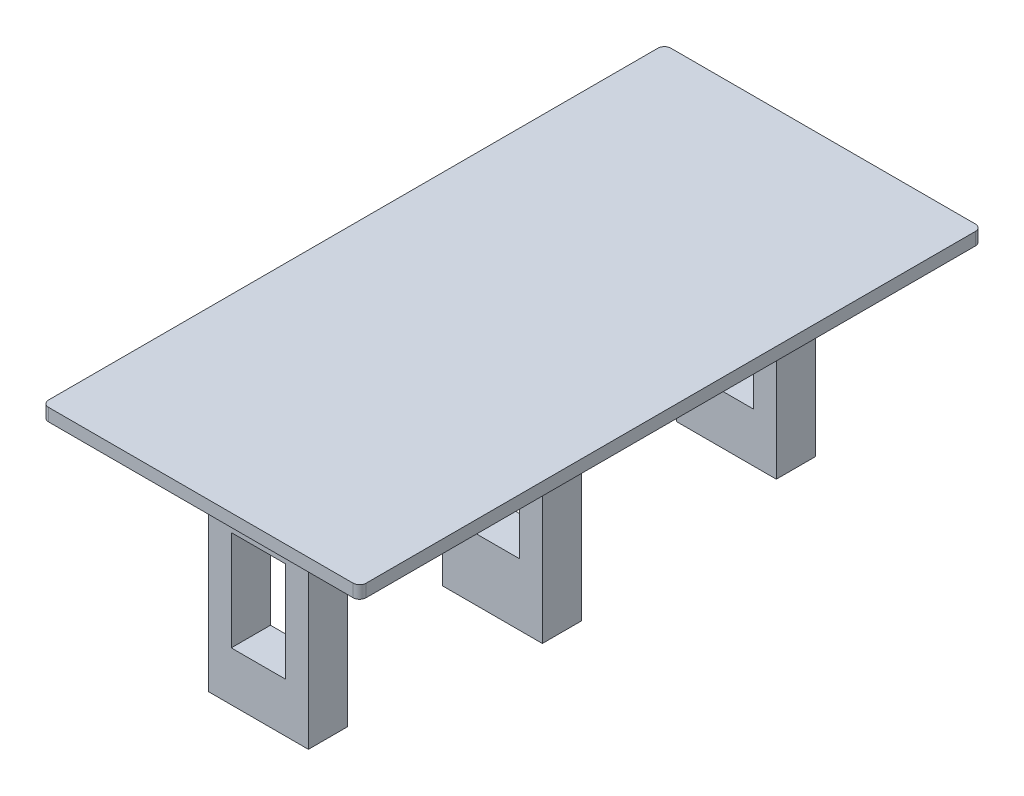
ISO-10303-21;
HEADER;
FILE_DESCRIPTION(('STEP AP214'),'2;1');
FILE_NAME('part.step','',(''),(''),'','','');
FILE_SCHEMA(('AUTOMOTIVE_DESIGN { 1 0 10303 214 1 1 1 1 }'));
ENDSEC;
DATA;
#1=APPLICATION_CONTEXT('core data for automotive mechanical design processes');
#2=APPLICATION_PROTOCOL_DEFINITION('international standard','automotive_design',2000,#1);
#3=PRODUCT_CONTEXT('',#1,'mechanical');
#4=PRODUCT('Part','Part','',(#3));
#5=PRODUCT_RELATED_PRODUCT_CATEGORY('part','',(#4));
#6=PRODUCT_DEFINITION_FORMATION('','',#4);
#7=PRODUCT_DEFINITION_CONTEXT('part definition',#1,'design');
#8=PRODUCT_DEFINITION('design','',#6,#7);
#9=PRODUCT_DEFINITION_SHAPE('','',#8);
#10=(LENGTH_UNIT() NAMED_UNIT(*) SI_UNIT(.MILLI.,.METRE.));
#11=(NAMED_UNIT(*) PLANE_ANGLE_UNIT() SI_UNIT($,.RADIAN.));
#12=(NAMED_UNIT(*) SI_UNIT($,.STERADIAN.) SOLID_ANGLE_UNIT());
#13=UNCERTAINTY_MEASURE_WITH_UNIT(LENGTH_MEASURE(1.E-05),#10,'distance_accuracy_value','');
#14=(GEOMETRIC_REPRESENTATION_CONTEXT(3) GLOBAL_UNCERTAINTY_ASSIGNED_CONTEXT((#13)) GLOBAL_UNIT_ASSIGNED_CONTEXT((#10,
#11,#12)) REPRESENTATION_CONTEXT('',''));
#15=CARTESIAN_POINT('',(0.,0.,0.));
#16=DIRECTION('',(0.,0.,1.));
#17=DIRECTION('',(1.,0.,0.));
#18=AXIS2_PLACEMENT_3D('',#15,#16,#17);
#19=CARTESIAN_POINT('',(-0.5461,-1.4986,0.3937));
#20=DIRECTION('',(1.,0.,0.));
#21=DIRECTION('',(0.,0.,-1.));
#22=AXIS2_PLACEMENT_3D('',#19,#20,#21);
#23=PLANE('',#22);
#24=DIRECTION('',(0.,1.,0.));
#25=VECTOR('',#24,1.);
#26=CARTESIAN_POINT('',(-0.5461,0.,0.3937));
#27=LINE('',#26,#25);
#28=CARTESIAN_POINT('',(-0.5461,-3.5052,0.3937));
#29=VERTEX_POINT('',#28);
#30=CARTESIAN_POINT('',(-0.5461,-1.4986,0.3937));
#31=VERTEX_POINT('',#30);
#32=EDGE_CURVE('E250',#29,#31,#27,.T.);
#33=ORIENTED_EDGE('',*,*,#32,.F.);
#34=DIRECTION('',(0.,0.,1.));
#35=VECTOR('',#34,1.);
#36=CARTESIAN_POINT('',(-0.5461,-3.5052,0.3937));
#37=LINE('',#36,#35);
#38=CARTESIAN_POINT('',(-0.5461,-3.5052,-0.3937));
#39=VERTEX_POINT('',#38);
#40=EDGE_CURVE('E337',#39,#29,#37,.T.);
#41=ORIENTED_EDGE('',*,*,#40,.F.);
#42=DIRECTION('',(0.,1.,0.));
#43=VECTOR('',#42,1.);
#44=CARTESIAN_POINT('',(-0.5461,0.,-0.3937));
#45=LINE('',#44,#43);
#46=CARTESIAN_POINT('',(-0.5461,-1.4986,-0.3937));
#47=VERTEX_POINT('',#46);
#48=EDGE_CURVE('E262',#39,#47,#45,.T.);
#49=ORIENTED_EDGE('',*,*,#48,.T.);
#50=DIRECTION('',(0.,0.,-1.));
#51=VECTOR('',#50,1.);
#52=CARTESIAN_POINT('',(-0.5461,-1.4986,0.3937));
#53=LINE('',#52,#51);
#54=EDGE_CURVE('E343',#31,#47,#53,.T.);
#55=ORIENTED_EDGE('',*,*,#54,.F.);
#56=EDGE_LOOP('',(#33,#41,#49,#55));
#57=FACE_BOUND('',#56,.T.);
#58=ADVANCED_FACE('F17',(#57),#23,.T.);
#59=CARTESIAN_POINT('',(0.5461,-1.4986,0.3937));
#60=DIRECTION('',(0.,-1.,0.));
#61=DIRECTION('',(0.,0.,-1.));
#62=AXIS2_PLACEMENT_3D('',#59,#60,#61);
#63=PLANE('',#62);
#64=DIRECTION('',(1.,0.,0.));
#65=VECTOR('',#64,1.);
#66=CARTESIAN_POINT('',(0.,-1.4986,0.3937));
#67=LINE('',#66,#65);
#68=CARTESIAN_POINT('',(0.5461,-1.4986,0.3937));
#69=VERTEX_POINT('',#68);
#70=EDGE_CURVE('E247',#31,#69,#67,.T.);
#71=ORIENTED_EDGE('',*,*,#70,.F.);
#72=ORIENTED_EDGE('',*,*,#54,.T.);
#73=DIRECTION('',(1.,0.,0.));
#74=VECTOR('',#73,1.);
#75=CARTESIAN_POINT('',(0.,-1.4986,-0.3937));
#76=LINE('',#75,#74);
#77=CARTESIAN_POINT('',(0.5461,-1.4986,-0.3937));
#78=VERTEX_POINT('',#77);
#79=EDGE_CURVE('E271',#47,#78,#76,.T.);
#80=ORIENTED_EDGE('',*,*,#79,.T.);
#81=DIRECTION('',(0.,0.,1.));
#82=VECTOR('',#81,1.);
#83=CARTESIAN_POINT('',(0.5461,-1.4986,0.3937));
#84=LINE('',#83,#82);
#85=EDGE_CURVE('E340',#69,#78,#84,.F.);
#86=ORIENTED_EDGE('',*,*,#85,.F.);
#87=EDGE_LOOP('',(#71,#72,#80,#86));
#88=FACE_BOUND('',#87,.T.);
#89=ADVANCED_FACE('F716',(#88),#63,.T.);
#90=CARTESIAN_POINT('',(0.5461,-3.5052,0.3937));
#91=DIRECTION('',(-1.,0.,0.));
#92=DIRECTION('',(0.,0.,1.));
#93=AXIS2_PLACEMENT_3D('',#90,#91,#92);
#94=PLANE('',#93);
#95=DIRECTION('',(0.,1.,0.));
#96=VECTOR('',#95,1.);
#97=CARTESIAN_POINT('',(0.5461,0.,0.3937));
#98=LINE('',#97,#96);
#99=CARTESIAN_POINT('',(0.5461,-3.5052,0.3937));
#100=VERTEX_POINT('',#99);
#101=EDGE_CURVE('E244',#69,#100,#98,.F.);
#102=ORIENTED_EDGE('',*,*,#101,.F.);
#103=ORIENTED_EDGE('',*,*,#85,.T.);
#104=DIRECTION('',(0.,1.,0.));
#105=VECTOR('',#104,1.);
#106=CARTESIAN_POINT('',(0.5461,0.,-0.3937));
#107=LINE('',#106,#105);
#108=CARTESIAN_POINT('',(0.5461,-3.5052,-0.3937));
#109=VERTEX_POINT('',#108);
#110=EDGE_CURVE('E268',#78,#109,#107,.F.);
#111=ORIENTED_EDGE('',*,*,#110,.T.);
#112=DIRECTION('',(0.,0.,1.));
#113=VECTOR('',#112,1.);
#114=CARTESIAN_POINT('',(0.5461,-3.5052,0.3937));
#115=LINE('',#114,#113);
#116=EDGE_CURVE('E334',#100,#109,#115,.F.);
#117=ORIENTED_EDGE('',*,*,#116,.F.);
#118=EDGE_LOOP('',(#102,#103,#111,#117));
#119=FACE_BOUND('',#118,.T.);
#120=ADVANCED_FACE('F706',(#119),#94,.T.);
#121=CARTESIAN_POINT('',(-0.5461,-3.5052,0.3937));
#122=DIRECTION('',(0.,1.,0.));
#123=DIRECTION('',(0.,0.,1.));
#124=AXIS2_PLACEMENT_3D('',#121,#122,#123);
#125=PLANE('',#124);
#126=DIRECTION('',(1.,0.,0.));
#127=VECTOR('',#126,1.);
#128=CARTESIAN_POINT('',(0.,-3.5052,0.3937));
#129=LINE('',#128,#127);
#130=EDGE_CURVE('E241',#100,#29,#129,.F.);
#131=ORIENTED_EDGE('',*,*,#130,.F.);
#132=ORIENTED_EDGE('',*,*,#116,.T.);
#133=DIRECTION('',(1.,0.,0.));
#134=VECTOR('',#133,1.);
#135=CARTESIAN_POINT('',(0.,-3.5052,-0.3937));
#136=LINE('',#135,#134);
#137=EDGE_CURVE('E265',#109,#39,#136,.F.);
#138=ORIENTED_EDGE('',*,*,#137,.T.);
#139=ORIENTED_EDGE('',*,*,#40,.T.);
#140=EDGE_LOOP('',(#131,#132,#138,#139));
#141=FACE_BOUND('',#140,.T.);
#142=ADVANCED_FACE('F696',(#141),#125,.T.);
#143=CARTESIAN_POINT('',(-1.0033,0.,0.3937));
#144=DIRECTION('',(1.,0.,0.));
#145=DIRECTION('',(0.,0.,-1.));
#146=AXIS2_PLACEMENT_3D('',#143,#144,#145);
#147=PLANE('',#146);
#148=DIRECTION('',(0.,0.,1.));
#149=VECTOR('',#148,1.);
#150=CARTESIAN_POINT('',(-1.0033,-4.7498,0.3937));
#151=LINE('',#150,#149);
#152=CARTESIAN_POINT('',(-1.0033,-4.7498,-0.3937));
#153=VERTEX_POINT('',#152);
#154=CARTESIAN_POINT('',(-1.0033,-4.7498,0.3937));
#155=VERTEX_POINT('',#154);
#156=EDGE_CURVE('E328',#153,#155,#151,.T.);
#157=ORIENTED_EDGE('',*,*,#156,.T.);
#158=DIRECTION('',(0.,1.,0.));
#159=VECTOR('',#158,1.);
#160=CARTESIAN_POINT('',(-1.0033,0.,0.3937));
#161=LINE('',#160,#159);
#162=CARTESIAN_POINT('',(-1.0033,0.,0.3937));
#163=VERTEX_POINT('',#162);
#164=EDGE_CURVE('E238',#163,#155,#161,.F.);
#165=ORIENTED_EDGE('',*,*,#164,.F.);
#166=DIRECTION('',(0.,0.,-1.));
#167=VECTOR('',#166,1.);
#168=CARTESIAN_POINT('',(-1.0033,0.,0.3937));
#169=LINE('',#168,#167);
#170=CARTESIAN_POINT('',(-1.0033,0.,-0.3937));
#171=VERTEX_POINT('',#170);
#172=EDGE_CURVE('E331',#171,#163,#169,.F.);
#173=ORIENTED_EDGE('',*,*,#172,.F.);
#174=DIRECTION('',(0.,1.,0.));
#175=VECTOR('',#174,1.);
#176=CARTESIAN_POINT('',(-1.0033,0.,-0.3937));
#177=LINE('',#176,#175);
#178=EDGE_CURVE('E253',#171,#153,#177,.F.);
#179=ORIENTED_EDGE('',*,*,#178,.T.);
#180=EDGE_LOOP('',(#157,#165,#173,#179));
#181=FACE_BOUND('',#180,.T.);
#182=ADVANCED_FACE('F686',(#181),#147,.F.);
#183=CARTESIAN_POINT('',(-1.0033,-4.7498,0.3937));
#184=DIRECTION('',(0.,1.,0.));
#185=DIRECTION('',(0.,0.,1.));
#186=AXIS2_PLACEMENT_3D('',#183,#184,#185);
#187=PLANE('',#186);
#188=DIRECTION('',(0.,0.,1.));
#189=VECTOR('',#188,1.);
#190=CARTESIAN_POINT('',(1.0033,-4.7498,0.3937));
#191=LINE('',#190,#189);
#192=CARTESIAN_POINT('',(1.0033,-4.7498,-0.3937));
#193=VERTEX_POINT('',#192);
#194=CARTESIAN_POINT('',(1.0033,-4.7498,0.3937));
#195=VERTEX_POINT('',#194);
#196=EDGE_CURVE('E325',#193,#195,#191,.T.);
#197=ORIENTED_EDGE('',*,*,#196,.T.);
#198=DIRECTION('',(1.,0.,0.));
#199=VECTOR('',#198,1.);
#200=CARTESIAN_POINT('',(0.,-4.7498,0.3937));
#201=LINE('',#200,#199);
#202=EDGE_CURVE('E235',#155,#195,#201,.T.);
#203=ORIENTED_EDGE('',*,*,#202,.F.);
#204=ORIENTED_EDGE('',*,*,#156,.F.);
#205=DIRECTION('',(1.,0.,0.));
#206=VECTOR('',#205,1.);
#207=CARTESIAN_POINT('',(0.,-4.7498,-0.3937));
#208=LINE('',#207,#206);
#209=EDGE_CURVE('E259',#153,#193,#208,.T.);
#210=ORIENTED_EDGE('',*,*,#209,.T.);
#211=EDGE_LOOP('',(#197,#203,#204,#210));
#212=FACE_BOUND('',#211,.T.);
#213=ADVANCED_FACE('F676',(#212),#187,.F.);
#214=CARTESIAN_POINT('',(1.0033,-4.7498,0.3937));
#215=DIRECTION('',(-1.,0.,0.));
#216=DIRECTION('',(0.,0.,1.));
#217=AXIS2_PLACEMENT_3D('',#214,#215,#216);
#218=PLANE('',#217);
#219=DIRECTION('',(0.,0.,1.));
#220=VECTOR('',#219,1.);
#221=CARTESIAN_POINT('',(1.0033,0.,0.3937));
#222=LINE('',#221,#220);
#223=CARTESIAN_POINT('',(1.0033,0.,0.3937));
#224=VERTEX_POINT('',#223);
#225=CARTESIAN_POINT('',(1.0033,0.,-0.3937));
#226=VERTEX_POINT('',#225);
#227=EDGE_CURVE('E322',#224,#226,#222,.F.);
#228=ORIENTED_EDGE('',*,*,#227,.F.);
#229=DIRECTION('',(0.,1.,0.));
#230=VECTOR('',#229,1.);
#231=CARTESIAN_POINT('',(1.0033,0.,0.3937));
#232=LINE('',#231,#230);
#233=EDGE_CURVE('E232',#195,#224,#232,.T.);
#234=ORIENTED_EDGE('',*,*,#233,.F.);
#235=ORIENTED_EDGE('',*,*,#196,.F.);
#236=DIRECTION('',(0.,1.,0.));
#237=VECTOR('',#236,1.);
#238=CARTESIAN_POINT('',(1.0033,0.,-0.3937));
#239=LINE('',#238,#237);
#240=EDGE_CURVE('E256',#193,#226,#239,.T.);
#241=ORIENTED_EDGE('',*,*,#240,.T.);
#242=EDGE_LOOP('',(#228,#234,#235,#241));
#243=FACE_BOUND('',#242,.T.);
#244=ADVANCED_FACE('F666',(#243),#218,.F.);
#245=CARTESIAN_POINT('',(-0.5461,-1.2446,5.0927));
#246=DIRECTION('',(1.,0.,0.));
#247=DIRECTION('',(0.,0.,-1.));
#248=AXIS2_PLACEMENT_3D('',#245,#246,#247);
#249=PLANE('',#248);
#250=DIRECTION('',(0.,1.,0.));
#251=VECTOR('',#250,1.);
#252=CARTESIAN_POINT('',(-0.5461,0.,5.0927));
#253=LINE('',#252,#251);
#254=CARTESIAN_POINT('',(-0.5461,-3.2512,5.0927));
#255=VERTEX_POINT('',#254);
#256=CARTESIAN_POINT('',(-0.5461,-1.2446,5.0927));
#257=VERTEX_POINT('',#256);
#258=EDGE_CURVE('E208',#255,#257,#253,.T.);
#259=ORIENTED_EDGE('',*,*,#258,.F.);
#260=DIRECTION('',(0.,0.,1.));
#261=VECTOR('',#260,1.);
#262=CARTESIAN_POINT('',(-0.5461,-3.2512,5.0927));
#263=LINE('',#262,#261);
#264=CARTESIAN_POINT('',(-0.5461,-3.2512,4.3053));
#265=VERTEX_POINT('',#264);
#266=EDGE_CURVE('E313',#265,#255,#263,.T.);
#267=ORIENTED_EDGE('',*,*,#266,.F.);
#268=DIRECTION('',(0.,1.,0.));
#269=VECTOR('',#268,1.);
#270=CARTESIAN_POINT('',(-0.5461,0.,4.3053));
#271=LINE('',#270,#269);
#272=CARTESIAN_POINT('',(-0.5461,-1.2446,4.3053));
#273=VERTEX_POINT('',#272);
#274=EDGE_CURVE('E220',#265,#273,#271,.T.);
#275=ORIENTED_EDGE('',*,*,#274,.T.);
#276=DIRECTION('',(0.,0.,-1.));
#277=VECTOR('',#276,1.);
#278=CARTESIAN_POINT('',(-0.5461,-1.2446,5.0927));
#279=LINE('',#278,#277);
#280=EDGE_CURVE('E319',#257,#273,#279,.T.);
#281=ORIENTED_EDGE('',*,*,#280,.F.);
#282=EDGE_LOOP('',(#259,#267,#275,#281));
#283=FACE_BOUND('',#282,.T.);
#284=ADVANCED_FACE('F656',(#283),#249,.T.);
#285=CARTESIAN_POINT('',(0.5461,-1.2446,5.0927));
#286=DIRECTION('',(0.,-1.,0.));
#287=DIRECTION('',(0.,0.,-1.));
#288=AXIS2_PLACEMENT_3D('',#285,#286,#287);
#289=PLANE('',#288);
#290=DIRECTION('',(1.,0.,0.));
#291=VECTOR('',#290,1.);
#292=CARTESIAN_POINT('',(0.,-1.2446,5.0927));
#293=LINE('',#292,#291);
#294=CARTESIAN_POINT('',(0.5461,-1.2446,5.0927));
#295=VERTEX_POINT('',#294);
#296=EDGE_CURVE('E205',#257,#295,#293,.T.);
#297=ORIENTED_EDGE('',*,*,#296,.F.);
#298=ORIENTED_EDGE('',*,*,#280,.T.);
#299=DIRECTION('',(1.,0.,0.));
#300=VECTOR('',#299,1.);
#301=CARTESIAN_POINT('',(0.,-1.2446,4.3053));
#302=LINE('',#301,#300);
#303=CARTESIAN_POINT('',(0.5461,-1.2446,4.3053));
#304=VERTEX_POINT('',#303);
#305=EDGE_CURVE('E229',#273,#304,#302,.T.);
#306=ORIENTED_EDGE('',*,*,#305,.T.);
#307=DIRECTION('',(0.,0.,1.));
#308=VECTOR('',#307,1.);
#309=CARTESIAN_POINT('',(0.5461,-1.2446,5.0927));
#310=LINE('',#309,#308);
#311=EDGE_CURVE('E316',#295,#304,#310,.F.);
#312=ORIENTED_EDGE('',*,*,#311,.F.);
#313=EDGE_LOOP('',(#297,#298,#306,#312));
#314=FACE_BOUND('',#313,.T.);
#315=ADVANCED_FACE('F646',(#314),#289,.T.);
#316=CARTESIAN_POINT('',(0.5461,-3.2512,5.0927));
#317=DIRECTION('',(-1.,0.,0.));
#318=DIRECTION('',(0.,0.,1.));
#319=AXIS2_PLACEMENT_3D('',#316,#317,#318);
#320=PLANE('',#319);
#321=DIRECTION('',(0.,1.,0.));
#322=VECTOR('',#321,1.);
#323=CARTESIAN_POINT('',(0.5461,0.,5.0927));
#324=LINE('',#323,#322);
#325=CARTESIAN_POINT('',(0.5461,-3.2512,5.0927));
#326=VERTEX_POINT('',#325);
#327=EDGE_CURVE('E202',#295,#326,#324,.F.);
#328=ORIENTED_EDGE('',*,*,#327,.F.);
#329=ORIENTED_EDGE('',*,*,#311,.T.);
#330=DIRECTION('',(0.,1.,0.));
#331=VECTOR('',#330,1.);
#332=CARTESIAN_POINT('',(0.5461,0.,4.3053));
#333=LINE('',#332,#331);
#334=CARTESIAN_POINT('',(0.5461,-3.2512,4.3053));
#335=VERTEX_POINT('',#334);
#336=EDGE_CURVE('E226',#304,#335,#333,.F.);
#337=ORIENTED_EDGE('',*,*,#336,.T.);
#338=DIRECTION('',(0.,0.,1.));
#339=VECTOR('',#338,1.);
#340=CARTESIAN_POINT('',(0.5461,-3.2512,5.0927));
#341=LINE('',#340,#339);
#342=EDGE_CURVE('E310',#326,#335,#341,.F.);
#343=ORIENTED_EDGE('',*,*,#342,.F.);
#344=EDGE_LOOP('',(#328,#329,#337,#343));
#345=FACE_BOUND('',#344,.T.);
#346=ADVANCED_FACE('F636',(#345),#320,.T.);
#347=CARTESIAN_POINT('',(-0.5461,-3.2512,5.0927));
#348=DIRECTION('',(0.,1.,0.));
#349=DIRECTION('',(0.,0.,1.));
#350=AXIS2_PLACEMENT_3D('',#347,#348,#349);
#351=PLANE('',#350);
#352=DIRECTION('',(1.,0.,0.));
#353=VECTOR('',#352,1.);
#354=CARTESIAN_POINT('',(0.,-3.2512,5.0927));
#355=LINE('',#354,#353);
#356=EDGE_CURVE('E199',#326,#255,#355,.F.);
#357=ORIENTED_EDGE('',*,*,#356,.F.);
#358=ORIENTED_EDGE('',*,*,#342,.T.);
#359=DIRECTION('',(1.,0.,0.));
#360=VECTOR('',#359,1.);
#361=CARTESIAN_POINT('',(0.,-3.2512,4.3053));
#362=LINE('',#361,#360);
#363=EDGE_CURVE('E223',#335,#265,#362,.F.);
#364=ORIENTED_EDGE('',*,*,#363,.T.);
#365=ORIENTED_EDGE('',*,*,#266,.T.);
#366=EDGE_LOOP('',(#357,#358,#364,#365));
#367=FACE_BOUND('',#366,.T.);
#368=ADVANCED_FACE('F626',(#367),#351,.T.);
#369=CARTESIAN_POINT('',(-1.0033,0.,5.0927));
#370=DIRECTION('',(1.,0.,0.));
#371=DIRECTION('',(0.,0.,-1.));
#372=AXIS2_PLACEMENT_3D('',#369,#370,#371);
#373=PLANE('',#372);
#374=DIRECTION('',(0.,0.,1.));
#375=VECTOR('',#374,1.);
#376=CARTESIAN_POINT('',(-1.0033,-4.2418,5.0927));
#377=LINE('',#376,#375);
#378=CARTESIAN_POINT('',(-1.0033,-4.2418,4.3053));
#379=VERTEX_POINT('',#378);
#380=CARTESIAN_POINT('',(-1.0033,-4.2418,5.0927));
#381=VERTEX_POINT('',#380);
#382=EDGE_CURVE('E304',#379,#381,#377,.T.);
#383=ORIENTED_EDGE('',*,*,#382,.T.);
#384=DIRECTION('',(0.,1.,0.));
#385=VECTOR('',#384,1.);
#386=CARTESIAN_POINT('',(-1.0033,0.,5.0927));
#387=LINE('',#386,#385);
#388=CARTESIAN_POINT('',(-1.0033,0.,5.0927));
#389=VERTEX_POINT('',#388);
#390=EDGE_CURVE('E196',#389,#381,#387,.F.);
#391=ORIENTED_EDGE('',*,*,#390,.F.);
#392=DIRECTION('',(0.,0.,-1.));
#393=VECTOR('',#392,1.);
#394=CARTESIAN_POINT('',(-1.0033,0.,5.0927));
#395=LINE('',#394,#393);
#396=CARTESIAN_POINT('',(-1.0033,0.,4.3053));
#397=VERTEX_POINT('',#396);
#398=EDGE_CURVE('E307',#397,#389,#395,.F.);
#399=ORIENTED_EDGE('',*,*,#398,.F.);
#400=DIRECTION('',(0.,1.,0.));
#401=VECTOR('',#400,1.);
#402=CARTESIAN_POINT('',(-1.0033,0.,4.3053));
#403=LINE('',#402,#401);
#404=EDGE_CURVE('E211',#397,#379,#403,.F.);
#405=ORIENTED_EDGE('',*,*,#404,.T.);
#406=EDGE_LOOP('',(#383,#391,#399,#405));
#407=FACE_BOUND('',#406,.T.);
#408=ADVANCED_FACE('F616',(#407),#373,.F.);
#409=CARTESIAN_POINT('',(-1.0033,-4.2418,5.0927));
#410=DIRECTION('',(0.,1.,0.));
#411=DIRECTION('',(0.,0.,1.));
#412=AXIS2_PLACEMENT_3D('',#409,#410,#411);
#413=PLANE('',#412);
#414=DIRECTION('',(0.,0.,1.));
#415=VECTOR('',#414,1.);
#416=CARTESIAN_POINT('',(1.0033,-4.2418,5.0927));
#417=LINE('',#416,#415);
#418=CARTESIAN_POINT('',(1.0033,-4.2418,4.3053));
#419=VERTEX_POINT('',#418);
#420=CARTESIAN_POINT('',(1.0033,-4.2418,5.0927));
#421=VERTEX_POINT('',#420);
#422=EDGE_CURVE('E301',#419,#421,#417,.T.);
#423=ORIENTED_EDGE('',*,*,#422,.T.);
#424=DIRECTION('',(1.,0.,0.));
#425=VECTOR('',#424,1.);
#426=CARTESIAN_POINT('',(0.,-4.2418,5.0927));
#427=LINE('',#426,#425);
#428=EDGE_CURVE('E193',#381,#421,#427,.T.);
#429=ORIENTED_EDGE('',*,*,#428,.F.);
#430=ORIENTED_EDGE('',*,*,#382,.F.);
#431=DIRECTION('',(1.,0.,0.));
#432=VECTOR('',#431,1.);
#433=CARTESIAN_POINT('',(0.,-4.2418,4.3053));
#434=LINE('',#433,#432);
#435=EDGE_CURVE('E217',#379,#419,#434,.T.);
#436=ORIENTED_EDGE('',*,*,#435,.T.);
#437=EDGE_LOOP('',(#423,#429,#430,#436));
#438=FACE_BOUND('',#437,.T.);
#439=ADVANCED_FACE('F606',(#438),#413,.F.);
#440=CARTESIAN_POINT('',(1.0033,-4.2418,5.0927));
#441=DIRECTION('',(-1.,0.,0.));
#442=DIRECTION('',(0.,0.,1.));
#443=AXIS2_PLACEMENT_3D('',#440,#441,#442);
#444=PLANE('',#443);
#445=DIRECTION('',(0.,0.,1.));
#446=VECTOR('',#445,1.);
#447=CARTESIAN_POINT('',(1.0033,0.,5.0927));
#448=LINE('',#447,#446);
#449=CARTESIAN_POINT('',(1.0033,0.,5.0927));
#450=VERTEX_POINT('',#449);
#451=CARTESIAN_POINT('',(1.0033,0.,4.3053));
#452=VERTEX_POINT('',#451);
#453=EDGE_CURVE('E298',#450,#452,#448,.F.);
#454=ORIENTED_EDGE('',*,*,#453,.F.);
#455=DIRECTION('',(0.,1.,0.));
#456=VECTOR('',#455,1.);
#457=CARTESIAN_POINT('',(1.0033,0.,5.0927));
#458=LINE('',#457,#456);
#459=EDGE_CURVE('E190',#421,#450,#458,.T.);
#460=ORIENTED_EDGE('',*,*,#459,.F.);
#461=ORIENTED_EDGE('',*,*,#422,.F.);
#462=DIRECTION('',(0.,1.,0.));
#463=VECTOR('',#462,1.);
#464=CARTESIAN_POINT('',(1.0033,0.,4.3053));
#465=LINE('',#464,#463);
#466=EDGE_CURVE('E214',#419,#452,#465,.T.);
#467=ORIENTED_EDGE('',*,*,#466,.T.);
#468=EDGE_LOOP('',(#454,#460,#461,#467));
#469=FACE_BOUND('',#468,.T.);
#470=ADVANCED_FACE('F596',(#469),#444,.F.);
#471=CARTESIAN_POINT('',(-0.5461,-1.2446,-4.3053));
#472=DIRECTION('',(1.,0.,0.));
#473=DIRECTION('',(0.,0.,-1.));
#474=AXIS2_PLACEMENT_3D('',#471,#472,#473);
#475=PLANE('',#474);
#476=DIRECTION('',(0.,1.,0.));
#477=VECTOR('',#476,1.);
#478=CARTESIAN_POINT('',(-0.5461,0.,-4.3053));
#479=LINE('',#478,#477);
#480=CARTESIAN_POINT('',(-0.5461,-3.2512,-4.3053));
#481=VERTEX_POINT('',#480);
#482=CARTESIAN_POINT('',(-0.5461,-1.2446,-4.3053));
#483=VERTEX_POINT('',#482);
#484=EDGE_CURVE('E166',#481,#483,#479,.T.);
#485=ORIENTED_EDGE('',*,*,#484,.F.);
#486=DIRECTION('',(0.,0.,1.));
#487=VECTOR('',#486,1.);
#488=CARTESIAN_POINT('',(-0.5461,-3.2512,-4.3053));
#489=LINE('',#488,#487);
#490=CARTESIAN_POINT('',(-0.5461,-3.2512,-5.0927));
#491=VERTEX_POINT('',#490);
#492=EDGE_CURVE('E289',#491,#481,#489,.T.);
#493=ORIENTED_EDGE('',*,*,#492,.F.);
#494=DIRECTION('',(0.,1.,0.));
#495=VECTOR('',#494,1.);
#496=CARTESIAN_POINT('',(-0.5461,0.,-5.0927));
#497=LINE('',#496,#495);
#498=CARTESIAN_POINT('',(-0.5461,-1.2446,-5.0927));
#499=VERTEX_POINT('',#498);
#500=EDGE_CURVE('E178',#491,#499,#497,.T.);
#501=ORIENTED_EDGE('',*,*,#500,.T.);
#502=DIRECTION('',(0.,0.,-1.));
#503=VECTOR('',#502,1.);
#504=CARTESIAN_POINT('',(-0.5461,-1.2446,-4.3053));
#505=LINE('',#504,#503);
#506=EDGE_CURVE('E295',#483,#499,#505,.T.);
#507=ORIENTED_EDGE('',*,*,#506,.F.);
#508=EDGE_LOOP('',(#485,#493,#501,#507));
#509=FACE_BOUND('',#508,.T.);
#510=ADVANCED_FACE('F586',(#509),#475,.T.);
#511=CARTESIAN_POINT('',(0.5461,-1.2446,-4.3053));
#512=DIRECTION('',(0.,-1.,0.));
#513=DIRECTION('',(0.,0.,-1.));
#514=AXIS2_PLACEMENT_3D('',#511,#512,#513);
#515=PLANE('',#514);
#516=DIRECTION('',(1.,0.,0.));
#517=VECTOR('',#516,1.);
#518=CARTESIAN_POINT('',(0.,-1.2446,-4.3053));
#519=LINE('',#518,#517);
#520=CARTESIAN_POINT('',(0.5461,-1.2446,-4.3053));
#521=VERTEX_POINT('',#520);
#522=EDGE_CURVE('E163',#483,#521,#519,.T.);
#523=ORIENTED_EDGE('',*,*,#522,.F.);
#524=ORIENTED_EDGE('',*,*,#506,.T.);
#525=DIRECTION('',(1.,0.,0.));
#526=VECTOR('',#525,1.);
#527=CARTESIAN_POINT('',(0.,-1.2446,-5.0927));
#528=LINE('',#527,#526);
#529=CARTESIAN_POINT('',(0.5461,-1.2446,-5.0927));
#530=VERTEX_POINT('',#529);
#531=EDGE_CURVE('E187',#499,#530,#528,.T.);
#532=ORIENTED_EDGE('',*,*,#531,.T.);
#533=DIRECTION('',(0.,0.,1.));
#534=VECTOR('',#533,1.);
#535=CARTESIAN_POINT('',(0.5461,-1.2446,-4.3053));
#536=LINE('',#535,#534);
#537=EDGE_CURVE('E292',#521,#530,#536,.F.);
#538=ORIENTED_EDGE('',*,*,#537,.F.);
#539=EDGE_LOOP('',(#523,#524,#532,#538));
#540=FACE_BOUND('',#539,.T.);
#541=ADVANCED_FACE('F576',(#540),#515,.T.);
#542=CARTESIAN_POINT('',(0.5461,-3.2512,-4.3053));
#543=DIRECTION('',(-1.,0.,0.));
#544=DIRECTION('',(0.,0.,1.));
#545=AXIS2_PLACEMENT_3D('',#542,#543,#544);
#546=PLANE('',#545);
#547=DIRECTION('',(0.,1.,0.));
#548=VECTOR('',#547,1.);
#549=CARTESIAN_POINT('',(0.5461,0.,-4.3053));
#550=LINE('',#549,#548);
#551=CARTESIAN_POINT('',(0.5461,-3.2512,-4.3053));
#552=VERTEX_POINT('',#551);
#553=EDGE_CURVE('E160',#521,#552,#550,.F.);
#554=ORIENTED_EDGE('',*,*,#553,.F.);
#555=ORIENTED_EDGE('',*,*,#537,.T.);
#556=DIRECTION('',(0.,1.,0.));
#557=VECTOR('',#556,1.);
#558=CARTESIAN_POINT('',(0.5461,0.,-5.0927));
#559=LINE('',#558,#557);
#560=CARTESIAN_POINT('',(0.5461,-3.2512,-5.0927));
#561=VERTEX_POINT('',#560);
#562=EDGE_CURVE('E184',#530,#561,#559,.F.);
#563=ORIENTED_EDGE('',*,*,#562,.T.);
#564=DIRECTION('',(0.,0.,1.));
#565=VECTOR('',#564,1.);
#566=CARTESIAN_POINT('',(0.5461,-3.2512,-4.3053));
#567=LINE('',#566,#565);
#568=EDGE_CURVE('E286',#552,#561,#567,.F.);
#569=ORIENTED_EDGE('',*,*,#568,.F.);
#570=EDGE_LOOP('',(#554,#555,#563,#569));
#571=FACE_BOUND('',#570,.T.);
#572=ADVANCED_FACE('F566',(#571),#546,.T.);
#573=CARTESIAN_POINT('',(-0.5461,-3.2512,-4.3053));
#574=DIRECTION('',(0.,1.,0.));
#575=DIRECTION('',(0.,0.,1.));
#576=AXIS2_PLACEMENT_3D('',#573,#574,#575);
#577=PLANE('',#576);
#578=DIRECTION('',(1.,0.,0.));
#579=VECTOR('',#578,1.);
#580=CARTESIAN_POINT('',(0.,-3.2512,-4.3053));
#581=LINE('',#580,#579);
#582=EDGE_CURVE('E157',#552,#481,#581,.F.);
#583=ORIENTED_EDGE('',*,*,#582,.F.);
#584=ORIENTED_EDGE('',*,*,#568,.T.);
#585=DIRECTION('',(1.,0.,0.));
#586=VECTOR('',#585,1.);
#587=CARTESIAN_POINT('',(0.,-3.2512,-5.0927));
#588=LINE('',#587,#586);
#589=EDGE_CURVE('E181',#561,#491,#588,.F.);
#590=ORIENTED_EDGE('',*,*,#589,.T.);
#591=ORIENTED_EDGE('',*,*,#492,.T.);
#592=EDGE_LOOP('',(#583,#584,#590,#591));
#593=FACE_BOUND('',#592,.T.);
#594=ADVANCED_FACE('F556',(#593),#577,.T.);
#595=CARTESIAN_POINT('',(-1.0033,0.,-4.3053));
#596=DIRECTION('',(1.,0.,0.));
#597=DIRECTION('',(0.,0.,-1.));
#598=AXIS2_PLACEMENT_3D('',#595,#596,#597);
#599=PLANE('',#598);
#600=DIRECTION('',(0.,0.,1.));
#601=VECTOR('',#600,1.);
#602=CARTESIAN_POINT('',(-1.0033,-4.2418,-4.3053));
#603=LINE('',#602,#601);
#604=CARTESIAN_POINT('',(-1.0033,-4.2418,-5.0927));
#605=VERTEX_POINT('',#604);
#606=CARTESIAN_POINT('',(-1.0033,-4.2418,-4.3053));
#607=VERTEX_POINT('',#606);
#608=EDGE_CURVE('E280',#605,#607,#603,.T.);
#609=ORIENTED_EDGE('',*,*,#608,.T.);
#610=DIRECTION('',(0.,1.,0.));
#611=VECTOR('',#610,1.);
#612=CARTESIAN_POINT('',(-1.0033,0.,-4.3053));
#613=LINE('',#612,#611);
#614=CARTESIAN_POINT('',(-1.0033,0.,-4.3053));
#615=VERTEX_POINT('',#614);
#616=EDGE_CURVE('E154',#615,#607,#613,.F.);
#617=ORIENTED_EDGE('',*,*,#616,.F.);
#618=DIRECTION('',(0.,0.,-1.));
#619=VECTOR('',#618,1.);
#620=CARTESIAN_POINT('',(-1.0033,0.,-4.3053));
#621=LINE('',#620,#619);
#622=CARTESIAN_POINT('',(-1.0033,0.,-5.0927));
#623=VERTEX_POINT('',#622);
#624=EDGE_CURVE('E283',#623,#615,#621,.F.);
#625=ORIENTED_EDGE('',*,*,#624,.F.);
#626=DIRECTION('',(0.,1.,0.));
#627=VECTOR('',#626,1.);
#628=CARTESIAN_POINT('',(-1.0033,0.,-5.0927));
#629=LINE('',#628,#627);
#630=EDGE_CURVE('E169',#623,#605,#629,.F.);
#631=ORIENTED_EDGE('',*,*,#630,.T.);
#632=EDGE_LOOP('',(#609,#617,#625,#631));
#633=FACE_BOUND('',#632,.T.);
#634=ADVANCED_FACE('F546',(#633),#599,.F.);
#635=CARTESIAN_POINT('',(-1.0033,-4.2418,-4.3053));
#636=DIRECTION('',(0.,1.,0.));
#637=DIRECTION('',(0.,0.,1.));
#638=AXIS2_PLACEMENT_3D('',#635,#636,#637);
#639=PLANE('',#638);
#640=DIRECTION('',(0.,0.,1.));
#641=VECTOR('',#640,1.);
#642=CARTESIAN_POINT('',(1.0033,-4.2418,-4.3053));
#643=LINE('',#642,#641);
#644=CARTESIAN_POINT('',(1.0033,-4.2418,-5.0927));
#645=VERTEX_POINT('',#644);
#646=CARTESIAN_POINT('',(1.0033,-4.2418,-4.3053));
#647=VERTEX_POINT('',#646);
#648=EDGE_CURVE('E277',#645,#647,#643,.T.);
#649=ORIENTED_EDGE('',*,*,#648,.T.);
#650=DIRECTION('',(1.,0.,0.));
#651=VECTOR('',#650,1.);
#652=CARTESIAN_POINT('',(0.,-4.2418,-4.3053));
#653=LINE('',#652,#651);
#654=EDGE_CURVE('E151',#607,#647,#653,.T.);
#655=ORIENTED_EDGE('',*,*,#654,.F.);
#656=ORIENTED_EDGE('',*,*,#608,.F.);
#657=DIRECTION('',(1.,0.,0.));
#658=VECTOR('',#657,1.);
#659=CARTESIAN_POINT('',(0.,-4.2418,-5.0927));
#660=LINE('',#659,#658);
#661=EDGE_CURVE('E175',#605,#645,#660,.T.);
#662=ORIENTED_EDGE('',*,*,#661,.T.);
#663=EDGE_LOOP('',(#649,#655,#656,#662));
#664=FACE_BOUND('',#663,.T.);
#665=ADVANCED_FACE('F536',(#664),#639,.F.);
#666=CARTESIAN_POINT('',(1.0033,-4.2418,-4.3053));
#667=DIRECTION('',(-1.,0.,0.));
#668=DIRECTION('',(0.,0.,1.));
#669=AXIS2_PLACEMENT_3D('',#666,#667,#668);
#670=PLANE('',#669);
#671=DIRECTION('',(0.,0.,1.));
#672=VECTOR('',#671,1.);
#673=CARTESIAN_POINT('',(1.0033,0.,-4.3053));
#674=LINE('',#673,#672);
#675=CARTESIAN_POINT('',(1.0033,0.,-4.3053));
#676=VERTEX_POINT('',#675);
#677=CARTESIAN_POINT('',(1.0033,0.,-5.0927));
#678=VERTEX_POINT('',#677);
#679=EDGE_CURVE('E274',#676,#678,#674,.F.);
#680=ORIENTED_EDGE('',*,*,#679,.F.);
#681=DIRECTION('',(0.,1.,0.));
#682=VECTOR('',#681,1.);
#683=CARTESIAN_POINT('',(1.0033,0.,-4.3053));
#684=LINE('',#683,#682);
#685=EDGE_CURVE('E145',#647,#676,#684,.T.);
#686=ORIENTED_EDGE('',*,*,#685,.F.);
#687=ORIENTED_EDGE('',*,*,#648,.F.);
#688=DIRECTION('',(0.,1.,0.));
#689=VECTOR('',#688,1.);
#690=CARTESIAN_POINT('',(1.0033,0.,-5.0927));
#691=LINE('',#690,#689);
#692=EDGE_CURVE('E172',#645,#678,#691,.T.);
#693=ORIENTED_EDGE('',*,*,#692,.T.);
#694=EDGE_LOOP('',(#680,#686,#687,#693));
#695=FACE_BOUND('',#694,.T.);
#696=ADVANCED_FACE('F526',(#695),#670,.F.);
#697=CARTESIAN_POINT('',(0.,0.,-0.3937));
#698=DIRECTION('',(0.,0.,1.));
#699=DIRECTION('',(1.,0.,0.));
#700=AXIS2_PLACEMENT_3D('',#697,#698,#699);
#701=PLANE('',#700);
#702=DIRECTION('',(1.,0.,0.));
#703=VECTOR('',#702,1.);
#704=CARTESIAN_POINT('',(-3.057652,0.,-0.3937));
#705=LINE('',#704,#703);
#706=EDGE_CURVE('E142',#171,#226,#705,.T.);
#707=ORIENTED_EDGE('',*,*,#706,.T.);
#708=ORIENTED_EDGE('',*,*,#240,.F.);
#709=ORIENTED_EDGE('',*,*,#209,.F.);
#710=ORIENTED_EDGE('',*,*,#178,.F.);
#711=EDGE_LOOP('',(#707,#708,#709,#710));
#712=FACE_BOUND('',#711,.T.);
#713=ORIENTED_EDGE('',*,*,#137,.F.);
#714=ORIENTED_EDGE('',*,*,#110,.F.);
#715=ORIENTED_EDGE('',*,*,#79,.F.);
#716=ORIENTED_EDGE('',*,*,#48,.F.);
#717=EDGE_LOOP('',(#713,#714,#715,#716));
#718=FACE_BOUND('',#717,.T.);
#719=ADVANCED_FACE('F516',(#712,#718),#701,.F.);
#720=CARTESIAN_POINT('',(0.,0.,0.3937));
#721=DIRECTION('',(0.,0.,1.));
#722=DIRECTION('',(1.,0.,0.));
#723=AXIS2_PLACEMENT_3D('',#720,#721,#722);
#724=PLANE('',#723);
#725=ORIENTED_EDGE('',*,*,#233,.T.);
#726=DIRECTION('',(1.,0.,0.));
#727=VECTOR('',#726,1.);
#728=CARTESIAN_POINT('',(-3.057652,0.,0.3937));
#729=LINE('',#728,#727);
#730=EDGE_CURVE('E139',#224,#163,#729,.F.);
#731=ORIENTED_EDGE('',*,*,#730,.T.);
#732=ORIENTED_EDGE('',*,*,#164,.T.);
#733=ORIENTED_EDGE('',*,*,#202,.T.);
#734=EDGE_LOOP('',(#725,#731,#732,#733));
#735=FACE_BOUND('',#734,.T.);
#736=ORIENTED_EDGE('',*,*,#101,.T.);
#737=ORIENTED_EDGE('',*,*,#130,.T.);
#738=ORIENTED_EDGE('',*,*,#32,.T.);
#739=ORIENTED_EDGE('',*,*,#70,.T.);
#740=EDGE_LOOP('',(#736,#737,#738,#739));
#741=FACE_BOUND('',#740,.T.);
#742=ADVANCED_FACE('F506',(#735,#741),#724,.T.);
#743=CARTESIAN_POINT('',(0.,0.,4.3053));
#744=DIRECTION('',(0.,0.,1.));
#745=DIRECTION('',(1.,0.,0.));
#746=AXIS2_PLACEMENT_3D('',#743,#744,#745);
#747=PLANE('',#746);
#748=DIRECTION('',(1.,0.,0.));
#749=VECTOR('',#748,1.);
#750=CARTESIAN_POINT('',(-3.057652,0.,4.3053));
#751=LINE('',#750,#749);
#752=EDGE_CURVE('E136',#397,#452,#751,.T.);
#753=ORIENTED_EDGE('',*,*,#752,.T.);
#754=ORIENTED_EDGE('',*,*,#466,.F.);
#755=ORIENTED_EDGE('',*,*,#435,.F.);
#756=ORIENTED_EDGE('',*,*,#404,.F.);
#757=EDGE_LOOP('',(#753,#754,#755,#756));
#758=FACE_BOUND('',#757,.T.);
#759=ORIENTED_EDGE('',*,*,#363,.F.);
#760=ORIENTED_EDGE('',*,*,#336,.F.);
#761=ORIENTED_EDGE('',*,*,#305,.F.);
#762=ORIENTED_EDGE('',*,*,#274,.F.);
#763=EDGE_LOOP('',(#759,#760,#761,#762));
#764=FACE_BOUND('',#763,.T.);
#765=ADVANCED_FACE('F496',(#758,#764),#747,.F.);
#766=CARTESIAN_POINT('',(0.,0.,5.0927));
#767=DIRECTION('',(0.,0.,1.));
#768=DIRECTION('',(1.,0.,0.));
#769=AXIS2_PLACEMENT_3D('',#766,#767,#768);
#770=PLANE('',#769);
#771=ORIENTED_EDGE('',*,*,#459,.T.);
#772=DIRECTION('',(1.,0.,0.));
#773=VECTOR('',#772,1.);
#774=CARTESIAN_POINT('',(-3.057652,0.,5.0927));
#775=LINE('',#774,#773);
#776=EDGE_CURVE('E133',#450,#389,#775,.F.);
#777=ORIENTED_EDGE('',*,*,#776,.T.);
#778=ORIENTED_EDGE('',*,*,#390,.T.);
#779=ORIENTED_EDGE('',*,*,#428,.T.);
#780=EDGE_LOOP('',(#771,#777,#778,#779));
#781=FACE_BOUND('',#780,.T.);
#782=ORIENTED_EDGE('',*,*,#327,.T.);
#783=ORIENTED_EDGE('',*,*,#356,.T.);
#784=ORIENTED_EDGE('',*,*,#258,.T.);
#785=ORIENTED_EDGE('',*,*,#296,.T.);
#786=EDGE_LOOP('',(#782,#783,#784,#785));
#787=FACE_BOUND('',#786,.T.);
#788=ADVANCED_FACE('F486',(#781,#787),#770,.T.);
#789=CARTESIAN_POINT('',(0.,0.,-5.0927));
#790=DIRECTION('',(0.,0.,1.));
#791=DIRECTION('',(1.,0.,0.));
#792=AXIS2_PLACEMENT_3D('',#789,#790,#791);
#793=PLANE('',#792);
#794=DIRECTION('',(1.,0.,0.));
#795=VECTOR('',#794,1.);
#796=CARTESIAN_POINT('',(-3.057652,0.,-5.0927));
#797=LINE('',#796,#795);
#798=EDGE_CURVE('E130',#623,#678,#797,.T.);
#799=ORIENTED_EDGE('',*,*,#798,.T.);
#800=ORIENTED_EDGE('',*,*,#692,.F.);
#801=ORIENTED_EDGE('',*,*,#661,.F.);
#802=ORIENTED_EDGE('',*,*,#630,.F.);
#803=EDGE_LOOP('',(#799,#800,#801,#802));
#804=FACE_BOUND('',#803,.T.);
#805=ORIENTED_EDGE('',*,*,#589,.F.);
#806=ORIENTED_EDGE('',*,*,#562,.F.);
#807=ORIENTED_EDGE('',*,*,#531,.F.);
#808=ORIENTED_EDGE('',*,*,#500,.F.);
#809=EDGE_LOOP('',(#805,#806,#807,#808));
#810=FACE_BOUND('',#809,.T.);
#811=ADVANCED_FACE('F476',(#804,#810),#793,.F.);
#812=CARTESIAN_POINT('',(0.,0.,-4.3053));
#813=DIRECTION('',(0.,0.,1.));
#814=DIRECTION('',(1.,0.,0.));
#815=AXIS2_PLACEMENT_3D('',#812,#813,#814);
#816=PLANE('',#815);
#817=ORIENTED_EDGE('',*,*,#685,.T.);
#818=DIRECTION('',(1.,0.,0.));
#819=VECTOR('',#818,1.);
#820=CARTESIAN_POINT('',(-3.057652,0.,-4.3053));
#821=LINE('',#820,#819);
#822=EDGE_CURVE('E91',#676,#615,#821,.F.);
#823=ORIENTED_EDGE('',*,*,#822,.T.);
#824=ORIENTED_EDGE('',*,*,#616,.T.);
#825=ORIENTED_EDGE('',*,*,#654,.T.);
#826=EDGE_LOOP('',(#817,#823,#824,#825));
#827=FACE_BOUND('',#826,.T.);
#828=ORIENTED_EDGE('',*,*,#553,.T.);
#829=ORIENTED_EDGE('',*,*,#582,.T.);
#830=ORIENTED_EDGE('',*,*,#484,.T.);
#831=ORIENTED_EDGE('',*,*,#522,.T.);
#832=EDGE_LOOP('',(#828,#829,#830,#831));
#833=FACE_BOUND('',#832,.T.);
#834=ADVANCED_FACE('F467',(#827,#833),#816,.T.);
#835=CARTESIAN_POINT('',(-3.057652,0.,6.118352));
#836=DIRECTION('',(0.,1.,0.));
#837=DIRECTION('',(0.,0.,1.));
#838=AXIS2_PLACEMENT_3D('',#835,#836,#837);
#839=PLANE('',#838);
#840=CARTESIAN_POINT('',(-3.057652,0.,-6.118352));
#841=DIRECTION('',(0.,1.,0.));
#842=DIRECTION('',(0.,0.,1.));
#843=AXIS2_PLACEMENT_3D('',#840,#841,#842);
#844=CIRCLE('',#843,0.130048);
#845=CARTESIAN_POINT('',(-3.057652,0.,-6.2484));
#846=VERTEX_POINT('',#845);
#847=CARTESIAN_POINT('',(-3.1877,0.,-6.118352));
#848=VERTEX_POINT('',#847);
#849=EDGE_CURVE('E20',#846,#848,#844,.T.);
#850=ORIENTED_EDGE('',*,*,#849,.F.);
#851=DIRECTION('',(1.,0.,0.));
#852=VECTOR('',#851,1.);
#853=CARTESIAN_POINT('',(3.057652,0.,-6.2484));
#854=LINE('',#853,#852);
#855=CARTESIAN_POINT('',(3.057652,0.,-6.2484));
#856=VERTEX_POINT('',#855);
#857=EDGE_CURVE('E103',#846,#856,#854,.T.);
#858=ORIENTED_EDGE('',*,*,#857,.T.);
#859=CARTESIAN_POINT('',(3.057652,0.,-6.118352));
#860=DIRECTION('',(0.,1.,0.));
#861=DIRECTION('',(0.,0.,1.));
#862=AXIS2_PLACEMENT_3D('',#859,#860,#861);
#863=CIRCLE('',#862,0.130048000000002);
#864=CARTESIAN_POINT('',(3.1877,0.,-6.118352));
#865=VERTEX_POINT('',#864);
#866=EDGE_CURVE('E115',#865,#856,#863,.T.);
#867=ORIENTED_EDGE('',*,*,#866,.F.);
#868=DIRECTION('',(0.,0.,1.));
#869=VECTOR('',#868,1.);
#870=CARTESIAN_POINT('',(3.1877,0.,6.118352));
#871=LINE('',#870,#869);
#872=CARTESIAN_POINT('',(3.1877,0.,6.118352));
#873=VERTEX_POINT('',#872);
#874=EDGE_CURVE('E118',#865,#873,#871,.T.);
#875=ORIENTED_EDGE('',*,*,#874,.T.);
#876=CARTESIAN_POINT('',(3.057652,0.,6.118352));
#877=DIRECTION('',(0.,1.,0.));
#878=DIRECTION('',(0.,0.,1.));
#879=AXIS2_PLACEMENT_3D('',#876,#877,#878);
#880=CIRCLE('',#879,0.130047999999999);
#881=CARTESIAN_POINT('',(3.057652,0.,6.2484));
#882=VERTEX_POINT('',#881);
#883=EDGE_CURVE('E122',#882,#873,#880,.T.);
#884=ORIENTED_EDGE('',*,*,#883,.F.);
#885=DIRECTION('',(-1.,0.,0.));
#886=VECTOR('',#885,1.);
#887=CARTESIAN_POINT('',(-3.057652,0.,6.2484));
#888=LINE('',#887,#886);
#889=CARTESIAN_POINT('',(-3.057652,0.,6.2484));
#890=VERTEX_POINT('',#889);
#891=EDGE_CURVE('E125',#882,#890,#888,.T.);
#892=ORIENTED_EDGE('',*,*,#891,.T.);
#893=CARTESIAN_POINT('',(-3.057652,0.,6.118352));
#894=DIRECTION('',(0.,1.,0.));
#895=DIRECTION('',(0.,0.,1.));
#896=AXIS2_PLACEMENT_3D('',#893,#894,#895);
#897=CIRCLE('',#896,0.130047999999999);
#898=CARTESIAN_POINT('',(-3.1877,0.,6.118352));
#899=VERTEX_POINT('',#898);
#900=EDGE_CURVE('E96',#899,#890,#897,.T.);
#901=ORIENTED_EDGE('',*,*,#900,.F.);
#902=DIRECTION('',(0.,0.,-1.));
#903=VECTOR('',#902,1.);
#904=CARTESIAN_POINT('',(-3.1877,0.,-6.118352));
#905=LINE('',#904,#903);
#906=EDGE_CURVE('E90',#899,#848,#905,.T.);
#907=ORIENTED_EDGE('',*,*,#906,.T.);
#908=EDGE_LOOP('',(#850,#858,#867,#875,#884,#892,#901,#907));
#909=FACE_BOUND('',#908,.T.);
#910=ORIENTED_EDGE('',*,*,#822,.F.);
#911=ORIENTED_EDGE('',*,*,#679,.T.);
#912=ORIENTED_EDGE('',*,*,#798,.F.);
#913=ORIENTED_EDGE('',*,*,#624,.T.);
#914=EDGE_LOOP('',(#910,#911,#912,#913));
#915=FACE_BOUND('',#914,.T.);
#916=ORIENTED_EDGE('',*,*,#776,.F.);
#917=ORIENTED_EDGE('',*,*,#453,.T.);
#918=ORIENTED_EDGE('',*,*,#752,.F.);
#919=ORIENTED_EDGE('',*,*,#398,.T.);
#920=EDGE_LOOP('',(#916,#917,#918,#919));
#921=FACE_BOUND('',#920,.T.);
#922=ORIENTED_EDGE('',*,*,#730,.F.);
#923=ORIENTED_EDGE('',*,*,#227,.T.);
#924=ORIENTED_EDGE('',*,*,#706,.F.);
#925=ORIENTED_EDGE('',*,*,#172,.T.);
#926=EDGE_LOOP('',(#922,#923,#924,#925));
#927=FACE_BOUND('',#926,.T.);
#928=ADVANCED_FACE('F93',(#909,#915,#921,#927),#839,.F.);
#929=CARTESIAN_POINT('',(-3.1877,0.254,-6.118352));
#930=DIRECTION('',(1.,0.,0.));
#931=DIRECTION('',(0.,0.,-1.));
#932=AXIS2_PLACEMENT_3D('',#929,#930,#931);
#933=PLANE('',#932);
#934=DIRECTION('',(0.,1.,0.));
#935=VECTOR('',#934,1.);
#936=CARTESIAN_POINT('',(-3.1877,0.254,6.118352));
#937=LINE('',#936,#935);
#938=CARTESIAN_POINT('',(-3.1877,0.254,6.118352));
#939=VERTEX_POINT('',#938);
#940=EDGE_CURVE('E126',#939,#899,#937,.F.);
#941=ORIENTED_EDGE('',*,*,#940,.F.);
#942=DIRECTION('',(0.,0.,1.));
#943=VECTOR('',#942,1.);
#944=CARTESIAN_POINT('',(-3.1877,0.254,6.118352));
#945=LINE('',#944,#943);
#946=CARTESIAN_POINT('',(-3.1877,0.254,-6.118352));
#947=VERTEX_POINT('',#946);
#948=EDGE_CURVE('E102',#947,#939,#945,.T.);
#949=ORIENTED_EDGE('',*,*,#948,.F.);
#950=DIRECTION('',(0.,1.,0.));
#951=VECTOR('',#950,1.);
#952=CARTESIAN_POINT('',(-3.1877,0.254,-6.118352));
#953=LINE('',#952,#951);
#954=EDGE_CURVE('E89',#848,#947,#953,.T.);
#955=ORIENTED_EDGE('',*,*,#954,.F.);
#956=ORIENTED_EDGE('',*,*,#906,.F.);
#957=EDGE_LOOP('',(#941,#949,#955,#956));
#958=FACE_BOUND('',#957,.T.);
#959=ADVANCED_FACE('F100',(#958),#933,.F.);
#960=CARTESIAN_POINT('',(-3.057652,0.254,6.118352));
#961=DIRECTION('',(0.,1.,0.));
#962=DIRECTION('',(0.,0.,1.));
#963=AXIS2_PLACEMENT_3D('',#960,#961,#962);
#964=CYLINDRICAL_SURFACE('',#963,0.130047999999999);
#965=CARTESIAN_POINT('',(-3.057652,0.254,6.118352));
#966=DIRECTION('',(0.,1.,0.));
#967=DIRECTION('',(0.,0.,1.));
#968=AXIS2_PLACEMENT_3D('',#965,#966,#967);
#969=CIRCLE('',#968,0.130047999999999);
#970=CARTESIAN_POINT('',(-3.057652,0.254,6.2484));
#971=VERTEX_POINT('',#970);
#972=EDGE_CURVE('E354',#939,#971,#969,.T.);
#973=ORIENTED_EDGE('',*,*,#972,.F.);
#974=ORIENTED_EDGE('',*,*,#940,.T.);
#975=ORIENTED_EDGE('',*,*,#900,.T.);
#976=DIRECTION('',(0.,1.,0.));
#977=VECTOR('',#976,1.);
#978=CARTESIAN_POINT('',(-3.057652,0.254,6.2484));
#979=LINE('',#978,#977);
#980=EDGE_CURVE('E123',#890,#971,#979,.T.);
#981=ORIENTED_EDGE('',*,*,#980,.T.);
#982=EDGE_LOOP('',(#973,#974,#975,#981));
#983=FACE_BOUND('',#982,.T.);
#984=ADVANCED_FACE('F360',(#983),#964,.T.);
#985=CARTESIAN_POINT('',(-3.057652,0.254,6.2484));
#986=DIRECTION('',(0.,0.,-1.));
#987=DIRECTION('',(-1.,0.,0.));
#988=AXIS2_PLACEMENT_3D('',#985,#986,#987);
#989=PLANE('',#988);
#990=DIRECTION('',(0.,1.,0.));
#991=VECTOR('',#990,1.);
#992=CARTESIAN_POINT('',(3.057652,0.254,6.2484));
#993=LINE('',#992,#991);
#994=CARTESIAN_POINT('',(3.057652,0.254,6.2484));
#995=VERTEX_POINT('',#994);
#996=EDGE_CURVE('E119',#995,#882,#993,.F.);
#997=ORIENTED_EDGE('',*,*,#996,.F.);
#998=DIRECTION('',(1.,0.,0.));
#999=VECTOR('',#998,1.);
#1000=CARTESIAN_POINT('',(-3.057652,0.254,6.2484));
#1001=LINE('',#1000,#999);
#1002=EDGE_CURVE('E353',#971,#995,#1001,.T.);
#1003=ORIENTED_EDGE('',*,*,#1002,.F.);
#1004=ORIENTED_EDGE('',*,*,#980,.F.);
#1005=ORIENTED_EDGE('',*,*,#891,.F.);
#1006=EDGE_LOOP('',(#997,#1003,#1004,#1005));
#1007=FACE_BOUND('',#1006,.T.);
#1008=ADVANCED_FACE('F365',(#1007),#989,.F.);
#1009=CARTESIAN_POINT('',(3.057652,0.254,6.118352));
#1010=DIRECTION('',(0.,1.,0.));
#1011=DIRECTION('',(0.,0.,1.));
#1012=AXIS2_PLACEMENT_3D('',#1009,#1010,#1011);
#1013=CYLINDRICAL_SURFACE('',#1012,0.130047999999999);
#1014=CARTESIAN_POINT('',(3.057652,0.254,6.118352));
#1015=DIRECTION('',(0.,1.,0.));
#1016=DIRECTION('',(0.,0.,1.));
#1017=AXIS2_PLACEMENT_3D('',#1014,#1015,#1016);
#1018=CIRCLE('',#1017,0.130047999999999);
#1019=CARTESIAN_POINT('',(3.1877,0.254,6.118352));
#1020=VERTEX_POINT('',#1019);
#1021=EDGE_CURVE('E350',#995,#1020,#1018,.T.);
#1022=ORIENTED_EDGE('',*,*,#1021,.F.);
#1023=ORIENTED_EDGE('',*,*,#996,.T.);
#1024=ORIENTED_EDGE('',*,*,#883,.T.);
#1025=DIRECTION('',(0.,1.,0.));
#1026=VECTOR('',#1025,1.);
#1027=CARTESIAN_POINT('',(3.1877,0.254,6.118352));
#1028=LINE('',#1027,#1026);
#1029=EDGE_CURVE('E116',#873,#1020,#1028,.T.);
#1030=ORIENTED_EDGE('',*,*,#1029,.T.);
#1031=EDGE_LOOP('',(#1022,#1023,#1024,#1030));
#1032=FACE_BOUND('',#1031,.T.);
#1033=ADVANCED_FACE('F425',(#1032),#1013,.T.);
#1034=CARTESIAN_POINT('',(3.1877,0.254,6.118352));
#1035=DIRECTION('',(-1.,0.,0.));
#1036=DIRECTION('',(0.,0.,1.));
#1037=AXIS2_PLACEMENT_3D('',#1034,#1035,#1036);
#1038=PLANE('',#1037);
#1039=DIRECTION('',(0.,1.,0.));
#1040=VECTOR('',#1039,1.);
#1041=CARTESIAN_POINT('',(3.1877,0.254,-6.118352));
#1042=LINE('',#1041,#1040);
#1043=CARTESIAN_POINT('',(3.1877,0.254,-6.118352));
#1044=VERTEX_POINT('',#1043);
#1045=EDGE_CURVE('E112',#1044,#865,#1042,.F.);
#1046=ORIENTED_EDGE('',*,*,#1045,.F.);
#1047=DIRECTION('',(0.,0.,1.));
#1048=VECTOR('',#1047,1.);
#1049=CARTESIAN_POINT('',(3.1877,0.254,6.118352));
#1050=LINE('',#1049,#1048);
#1051=EDGE_CURVE('E349',#1020,#1044,#1050,.F.);
#1052=ORIENTED_EDGE('',*,*,#1051,.F.);
#1053=ORIENTED_EDGE('',*,*,#1029,.F.);
#1054=ORIENTED_EDGE('',*,*,#874,.F.);
#1055=EDGE_LOOP('',(#1046,#1052,#1053,#1054));
#1056=FACE_BOUND('',#1055,.T.);
#1057=ADVANCED_FACE('F379',(#1056),#1038,.F.);
#1058=CARTESIAN_POINT('',(3.057652,0.254,-6.118352));
#1059=DIRECTION('',(0.,1.,0.));
#1060=DIRECTION('',(0.,0.,1.));
#1061=AXIS2_PLACEMENT_3D('',#1058,#1059,#1060);
#1062=CYLINDRICAL_SURFACE('',#1061,0.130048000000002);
#1063=CARTESIAN_POINT('',(3.057652,0.254,-6.118352));
#1064=DIRECTION('',(0.,1.,0.));
#1065=DIRECTION('',(0.,0.,1.));
#1066=AXIS2_PLACEMENT_3D('',#1063,#1064,#1065);
#1067=CIRCLE('',#1066,0.130048000000002);
#1068=CARTESIAN_POINT('',(3.057652,0.254,-6.2484));
#1069=VERTEX_POINT('',#1068);
#1070=EDGE_CURVE('E346',#1044,#1069,#1067,.T.);
#1071=ORIENTED_EDGE('',*,*,#1070,.F.);
#1072=ORIENTED_EDGE('',*,*,#1045,.T.);
#1073=ORIENTED_EDGE('',*,*,#866,.T.);
#1074=DIRECTION('',(0.,1.,0.));
#1075=VECTOR('',#1074,1.);
#1076=CARTESIAN_POINT('',(3.057652,0.254,-6.2484));
#1077=LINE('',#1076,#1075);
#1078=EDGE_CURVE('E106',#856,#1069,#1077,.T.);
#1079=ORIENTED_EDGE('',*,*,#1078,.T.);
#1080=EDGE_LOOP('',(#1071,#1072,#1073,#1079));
#1081=FACE_BOUND('',#1080,.T.);
#1082=ADVANCED_FACE('F382',(#1081),#1062,.T.);
#1083=CARTESIAN_POINT('',(3.057652,0.254,-6.2484));
#1084=DIRECTION('',(0.,0.,1.));
#1085=DIRECTION('',(1.,0.,0.));
#1086=AXIS2_PLACEMENT_3D('',#1083,#1084,#1085);
#1087=PLANE('',#1086);
#1088=DIRECTION('',(0.,1.,0.));
#1089=VECTOR('',#1088,1.);
#1090=CARTESIAN_POINT('',(-3.057652,0.254,-6.2484));
#1091=LINE('',#1090,#1089);
#1092=CARTESIAN_POINT('',(-3.057652,0.254,-6.2484));
#1093=VERTEX_POINT('',#1092);
#1094=EDGE_CURVE('E35',#1093,#846,#1091,.F.);
#1095=ORIENTED_EDGE('',*,*,#1094,.F.);
#1096=DIRECTION('',(1.,0.,0.));
#1097=VECTOR('',#1096,1.);
#1098=CARTESIAN_POINT('',(-3.057652,0.254,-6.2484));
#1099=LINE('',#1098,#1097);
#1100=EDGE_CURVE('E26',#1069,#1093,#1099,.F.);
#1101=ORIENTED_EDGE('',*,*,#1100,.F.);
#1102=ORIENTED_EDGE('',*,*,#1078,.F.);
#1103=ORIENTED_EDGE('',*,*,#857,.F.);
#1104=EDGE_LOOP('',(#1095,#1101,#1102,#1103));
#1105=FACE_BOUND('',#1104,.T.);
#1106=ADVANCED_FACE('F383',(#1105),#1087,.F.);
#1107=CARTESIAN_POINT('',(-3.057652,0.254,-6.118352));
#1108=DIRECTION('',(0.,1.,0.));
#1109=DIRECTION('',(0.,0.,1.));
#1110=AXIS2_PLACEMENT_3D('',#1107,#1108,#1109);
#1111=CYLINDRICAL_SURFACE('',#1110,0.130048);
#1112=CARTESIAN_POINT('',(-3.057652,0.254,-6.118352));
#1113=DIRECTION('',(0.,1.,0.));
#1114=DIRECTION('',(0.,0.,1.));
#1115=AXIS2_PLACEMENT_3D('',#1112,#1113,#1114);
#1116=CIRCLE('',#1115,0.130048);
#1117=EDGE_CURVE('E11',#1093,#947,#1116,.T.);
#1118=ORIENTED_EDGE('',*,*,#1117,.F.);
#1119=ORIENTED_EDGE('',*,*,#1094,.T.);
#1120=ORIENTED_EDGE('',*,*,#849,.T.);
#1121=ORIENTED_EDGE('',*,*,#954,.T.);
#1122=EDGE_LOOP('',(#1118,#1119,#1120,#1121));
#1123=FACE_BOUND('',#1122,.T.);
#1124=ADVANCED_FACE('F87',(#1123),#1111,.T.);
#1125=CARTESIAN_POINT('',(-3.057652,0.254,6.118352));
#1126=DIRECTION('',(0.,1.,0.));
#1127=DIRECTION('',(0.,0.,1.));
#1128=AXIS2_PLACEMENT_3D('',#1125,#1126,#1127);
#1129=PLANE('',#1128);
#1130=ORIENTED_EDGE('',*,*,#1100,.T.);
#1131=ORIENTED_EDGE('',*,*,#1117,.T.);
#1132=ORIENTED_EDGE('',*,*,#948,.T.);
#1133=ORIENTED_EDGE('',*,*,#972,.T.);
#1134=ORIENTED_EDGE('',*,*,#1002,.T.);
#1135=ORIENTED_EDGE('',*,*,#1021,.T.);
#1136=ORIENTED_EDGE('',*,*,#1051,.T.);
#1137=ORIENTED_EDGE('',*,*,#1070,.T.);
#1138=EDGE_LOOP('',(#1130,#1131,#1132,#1133,#1134,#1135,#1136,#1137));
#1139=FACE_BOUND('',#1138,.T.);
#1140=ADVANCED_FACE('F370',(#1139),#1129,.T.);
#1141=CLOSED_SHELL('',(#58,#89,#120,#142,#182,#213,#244,#284,#315,#346,#368,#408,#439,#470,#510,
#541,#572,#594,#634,#665,#696,#719,#742,#765,#788,#811,#834,#928,#959,#984,#1008,#1033,#1057,
#1082,#1106,#1124,#1140));
#1142=MANIFOLD_SOLID_BREP('B1',#1141);
#1143=ADVANCED_BREP_SHAPE_REPRESENTATION('',(#18,#1142),#14);
#1144=SHAPE_DEFINITION_REPRESENTATION(#9,#1143);
ENDSEC;
END-ISO-10303-21;
